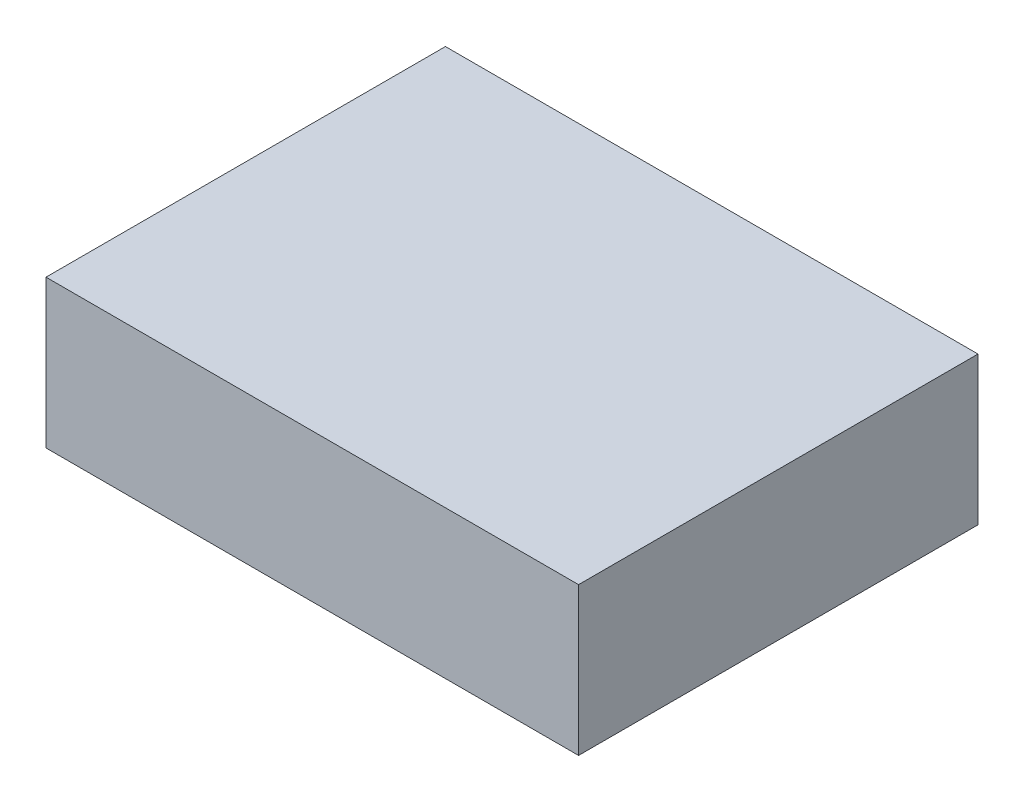
ISO-10303-21;
HEADER;
FILE_DESCRIPTION(('STEP AP214'),'2;1');
FILE_NAME('part.step','',(''),(''),'','','');
FILE_SCHEMA(('AUTOMOTIVE_DESIGN { 1 0 10303 214 1 1 1 1 }'));
ENDSEC;
DATA;
#1=APPLICATION_CONTEXT('core data for automotive mechanical design processes');
#2=APPLICATION_PROTOCOL_DEFINITION('international standard','automotive_design',2000,#1);
#3=PRODUCT_CONTEXT('',#1,'mechanical');
#4=PRODUCT('Part','Part','',(#3));
#5=PRODUCT_RELATED_PRODUCT_CATEGORY('part','',(#4));
#6=PRODUCT_DEFINITION_FORMATION('','',#4);
#7=PRODUCT_DEFINITION_CONTEXT('part definition',#1,'design');
#8=PRODUCT_DEFINITION('design','',#6,#7);
#9=PRODUCT_DEFINITION_SHAPE('','',#8);
#10=(LENGTH_UNIT() NAMED_UNIT(*) SI_UNIT(.MILLI.,.METRE.));
#11=(NAMED_UNIT(*) PLANE_ANGLE_UNIT() SI_UNIT($,.RADIAN.));
#12=(NAMED_UNIT(*) SI_UNIT($,.STERADIAN.) SOLID_ANGLE_UNIT());
#13=UNCERTAINTY_MEASURE_WITH_UNIT(LENGTH_MEASURE(1.E-05),#10,'distance_accuracy_value','');
#14=(GEOMETRIC_REPRESENTATION_CONTEXT(3) GLOBAL_UNCERTAINTY_ASSIGNED_CONTEXT((#13)) GLOBAL_UNIT_ASSIGNED_CONTEXT((#10,
#11,#12)) REPRESENTATION_CONTEXT('',''));
#15=CARTESIAN_POINT('',(0.,0.,0.));
#16=DIRECTION('',(0.,0.,1.));
#17=DIRECTION('',(1.,0.,0.));
#18=AXIS2_PLACEMENT_3D('',#15,#16,#17);
#19=CARTESIAN_POINT('',(0.90000074,-0.2499995,0.));
#20=DIRECTION('',(0.,-1.,0.));
#21=DIRECTION('',(-1.,0.,0.));
#22=AXIS2_PLACEMENT_3D('',#19,#20,#21);
#23=PLANE('',#22);
#24=DIRECTION('',(0.,0.,1.));
#25=VECTOR('',#24,1.);
#26=CARTESIAN_POINT('',(0.90000074,-0.2499995,0.));
#27=LINE('',#26,#25);
#28=CARTESIAN_POINT('',(0.90000074,-0.2499995,0.));
#29=VERTEX_POINT('',#28);
#30=CARTESIAN_POINT('',(0.90000074,-0.2499995,1.34999984));
#31=VERTEX_POINT('',#30);
#32=EDGE_CURVE('E11',#29,#31,#27,.T.);
#33=ORIENTED_EDGE('',*,*,#32,.T.);
#34=DIRECTION('',(-1.,0.,0.));
#35=VECTOR('',#34,1.);
#36=CARTESIAN_POINT('',(0.90000074,-0.2499995,1.34999984));
#37=LINE('',#36,#35);
#38=CARTESIAN_POINT('',(-0.8999982,-0.2499995,1.34999984));
#39=VERTEX_POINT('',#38);
#40=EDGE_CURVE('E24',#31,#39,#37,.T.);
#41=ORIENTED_EDGE('',*,*,#40,.T.);
#42=DIRECTION('',(0.,0.,1.));
#43=VECTOR('',#42,1.);
#44=CARTESIAN_POINT('',(-0.8999982,-0.2499995,0.));
#45=LINE('',#44,#43);
#46=CARTESIAN_POINT('',(-0.8999982,-0.2499995,0.));
#47=VERTEX_POINT('',#46);
#48=EDGE_CURVE('E85',#47,#39,#45,.T.);
#49=ORIENTED_EDGE('',*,*,#48,.F.);
#50=DIRECTION('',(-1.,0.,0.));
#51=VECTOR('',#50,1.);
#52=CARTESIAN_POINT('',(0.90000074,-0.2499995,0.));
#53=LINE('',#52,#51);
#54=EDGE_CURVE('E83',#29,#47,#53,.T.);
#55=ORIENTED_EDGE('',*,*,#54,.F.);
#56=EDGE_LOOP('',(#33,#41,#49,#55));
#57=FACE_BOUND('',#56,.T.);
#58=ADVANCED_FACE('F17',(#57),#23,.T.);
#59=CARTESIAN_POINT('',(-0.8999982,-0.2499995,0.));
#60=DIRECTION('',(-1.,0.,0.));
#61=DIRECTION('',(0.,1.,0.));
#62=AXIS2_PLACEMENT_3D('',#59,#60,#61);
#63=PLANE('',#62);
#64=ORIENTED_EDGE('',*,*,#48,.T.);
#65=DIRECTION('',(0.,1.,0.));
#66=VECTOR('',#65,1.);
#67=CARTESIAN_POINT('',(-0.8999982,-0.2499995,1.34999984));
#68=LINE('',#67,#66);
#69=CARTESIAN_POINT('',(-0.8999982,0.2499995,1.34999984));
#70=VERTEX_POINT('',#69);
#71=EDGE_CURVE('E81',#39,#70,#68,.T.);
#72=ORIENTED_EDGE('',*,*,#71,.T.);
#73=DIRECTION('',(0.,0.,1.));
#74=VECTOR('',#73,1.);
#75=CARTESIAN_POINT('',(-0.8999982,0.2499995,0.));
#76=LINE('',#75,#74);
#77=CARTESIAN_POINT('',(-0.8999982,0.2499995,0.));
#78=VERTEX_POINT('',#77);
#79=EDGE_CURVE('E79',#78,#70,#76,.T.);
#80=ORIENTED_EDGE('',*,*,#79,.F.);
#81=DIRECTION('',(0.,1.,0.));
#82=VECTOR('',#81,1.);
#83=CARTESIAN_POINT('',(-0.8999982,-0.2499995,0.));
#84=LINE('',#83,#82);
#85=EDGE_CURVE('E70',#47,#78,#84,.T.);
#86=ORIENTED_EDGE('',*,*,#85,.F.);
#87=EDGE_LOOP('',(#64,#72,#80,#86));
#88=FACE_BOUND('',#87,.T.);
#89=ADVANCED_FACE('F90',(#88),#63,.T.);
#90=CARTESIAN_POINT('',(-0.8999982,0.2499995,0.));
#91=DIRECTION('',(0.,1.,0.));
#92=DIRECTION('',(1.,0.,0.));
#93=AXIS2_PLACEMENT_3D('',#90,#91,#92);
#94=PLANE('',#93);
#95=ORIENTED_EDGE('',*,*,#79,.T.);
#96=DIRECTION('',(1.,0.,0.));
#97=VECTOR('',#96,1.);
#98=CARTESIAN_POINT('',(-0.8999982,0.2499995,1.34999984));
#99=LINE('',#98,#97);
#100=CARTESIAN_POINT('',(0.90000074,0.2499995,1.34999984));
#101=VERTEX_POINT('',#100);
#102=EDGE_CURVE('E60',#70,#101,#99,.T.);
#103=ORIENTED_EDGE('',*,*,#102,.T.);
#104=DIRECTION('',(0.,0.,1.));
#105=VECTOR('',#104,1.);
#106=CARTESIAN_POINT('',(0.90000074,0.2499995,0.));
#107=LINE('',#106,#105);
#108=CARTESIAN_POINT('',(0.90000074,0.2499995,0.));
#109=VERTEX_POINT('',#108);
#110=EDGE_CURVE('E54',#109,#101,#107,.T.);
#111=ORIENTED_EDGE('',*,*,#110,.F.);
#112=DIRECTION('',(1.,0.,0.));
#113=VECTOR('',#112,1.);
#114=CARTESIAN_POINT('',(-0.8999982,0.2499995,0.));
#115=LINE('',#114,#113);
#116=EDGE_CURVE('E58',#78,#109,#115,.T.);
#117=ORIENTED_EDGE('',*,*,#116,.F.);
#118=EDGE_LOOP('',(#95,#103,#111,#117));
#119=FACE_BOUND('',#118,.T.);
#120=ADVANCED_FACE('F57',(#119),#94,.T.);
#121=CARTESIAN_POINT('',(0.90000074,0.2499995,0.));
#122=DIRECTION('',(1.,0.,0.));
#123=DIRECTION('',(0.,-1.,0.));
#124=AXIS2_PLACEMENT_3D('',#121,#122,#123);
#125=PLANE('',#124);
#126=ORIENTED_EDGE('',*,*,#110,.T.);
#127=DIRECTION('',(0.,-1.,0.));
#128=VECTOR('',#127,1.);
#129=CARTESIAN_POINT('',(0.90000074,0.2499995,1.34999984));
#130=LINE('',#129,#128);
#131=EDGE_CURVE('E71',#101,#31,#130,.T.);
#132=ORIENTED_EDGE('',*,*,#131,.T.);
#133=ORIENTED_EDGE('',*,*,#32,.F.);
#134=DIRECTION('',(0.,-1.,0.));
#135=VECTOR('',#134,1.);
#136=CARTESIAN_POINT('',(0.90000074,0.2499995,0.));
#137=LINE('',#136,#135);
#138=EDGE_CURVE('E68',#109,#29,#137,.T.);
#139=ORIENTED_EDGE('',*,*,#138,.F.);
#140=EDGE_LOOP('',(#126,#132,#133,#139));
#141=FACE_BOUND('',#140,.T.);
#142=ADVANCED_FACE('F73',(#141),#125,.T.);
#143=CARTESIAN_POINT('',(0.90000074,-0.2499995,0.));
#144=DIRECTION('',(0.,0.,1.));
#145=DIRECTION('',(1.,0.,0.));
#146=AXIS2_PLACEMENT_3D('',#143,#144,#145);
#147=PLANE('',#146);
#148=ORIENTED_EDGE('',*,*,#54,.T.);
#149=ORIENTED_EDGE('',*,*,#85,.T.);
#150=ORIENTED_EDGE('',*,*,#116,.T.);
#151=ORIENTED_EDGE('',*,*,#138,.T.);
#152=EDGE_LOOP('',(#148,#149,#150,#151));
#153=FACE_BOUND('',#152,.T.);
#154=ADVANCED_FACE('F67',(#153),#147,.F.);
#155=CARTESIAN_POINT('',(0.90000074,-0.2499995,1.34999984));
#156=DIRECTION('',(0.,0.,1.));
#157=DIRECTION('',(1.,0.,0.));
#158=AXIS2_PLACEMENT_3D('',#155,#156,#157);
#159=PLANE('',#158);
#160=ORIENTED_EDGE('',*,*,#131,.F.);
#161=ORIENTED_EDGE('',*,*,#102,.F.);
#162=ORIENTED_EDGE('',*,*,#71,.F.);
#163=ORIENTED_EDGE('',*,*,#40,.F.);
#164=EDGE_LOOP('',(#160,#161,#162,#163));
#165=FACE_BOUND('',#164,.T.);
#166=ADVANCED_FACE('F91',(#165),#159,.T.);
#167=CLOSED_SHELL('',(#58,#89,#120,#142,#154,#166));
#168=MANIFOLD_SOLID_BREP('B1',#167);
#169=ADVANCED_BREP_SHAPE_REPRESENTATION('',(#18,#168),#14);
#170=SHAPE_DEFINITION_REPRESENTATION(#9,#169);
ENDSEC;
END-ISO-10303-21;
